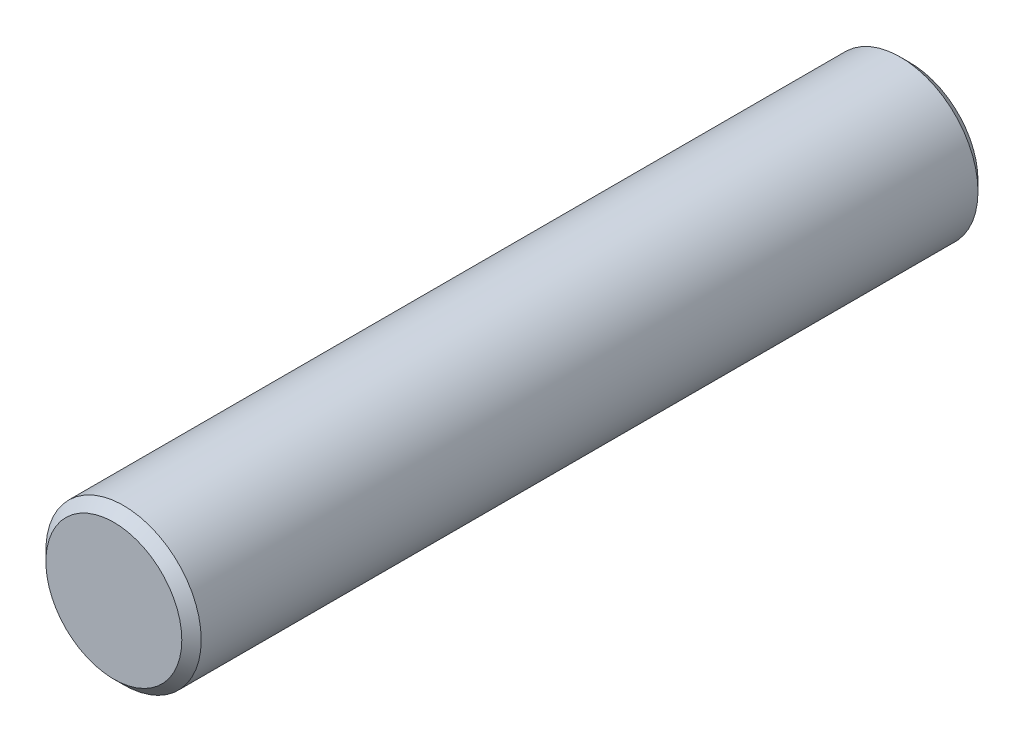
ISO-10303-21;
HEADER;
FILE_DESCRIPTION(('STEP AP214'),'2;1');
FILE_NAME('part.step','',(''),(''),'','','');
FILE_SCHEMA(('AUTOMOTIVE_DESIGN { 1 0 10303 214 1 1 1 1 }'));
ENDSEC;
DATA;
#1=APPLICATION_CONTEXT('core data for automotive mechanical design processes');
#2=APPLICATION_PROTOCOL_DEFINITION('international standard','automotive_design',2000,#1);
#3=PRODUCT_CONTEXT('',#1,'mechanical');
#4=PRODUCT('Part','Part','',(#3));
#5=PRODUCT_RELATED_PRODUCT_CATEGORY('part','',(#4));
#6=PRODUCT_DEFINITION_FORMATION('','',#4);
#7=PRODUCT_DEFINITION_CONTEXT('part definition',#1,'design');
#8=PRODUCT_DEFINITION('design','',#6,#7);
#9=PRODUCT_DEFINITION_SHAPE('','',#8);
#10=(LENGTH_UNIT() NAMED_UNIT(*) SI_UNIT(.MILLI.,.METRE.));
#11=(NAMED_UNIT(*) PLANE_ANGLE_UNIT() SI_UNIT($,.RADIAN.));
#12=(NAMED_UNIT(*) SI_UNIT($,.STERADIAN.) SOLID_ANGLE_UNIT());
#13=UNCERTAINTY_MEASURE_WITH_UNIT(LENGTH_MEASURE(1.E-05),#10,'distance_accuracy_value','');
#14=(GEOMETRIC_REPRESENTATION_CONTEXT(3) GLOBAL_UNCERTAINTY_ASSIGNED_CONTEXT((#13)) GLOBAL_UNIT_ASSIGNED_CONTEXT((#10,
#11,#12)) REPRESENTATION_CONTEXT('',''));
#15=CARTESIAN_POINT('',(0.,0.,0.));
#16=DIRECTION('',(0.,0.,1.));
#17=DIRECTION('',(1.,0.,0.));
#18=AXIS2_PLACEMENT_3D('',#15,#16,#17);
#19=CARTESIAN_POINT('',(0.,0.,41.));
#20=DIRECTION('',(0.,0.,-1.));
#21=DIRECTION('',(-1.,0.,0.));
#22=AXIS2_PLACEMENT_3D('',#19,#20,#21);
#23=CYLINDRICAL_SURFACE('',#22,8.);
#24=CARTESIAN_POINT('',(0.,0.,-40.));
#25=DIRECTION('',(0.,0.,1.));
#26=DIRECTION('',(1.,0.,0.));
#27=AXIS2_PLACEMENT_3D('',#24,#25,#26);
#28=CIRCLE('',#27,8.);
#29=CARTESIAN_POINT('',(8.,0.,-40.));
#30=VERTEX_POINT('',#29);
#31=EDGE_CURVE('E50',#30,#30,#28,.T.);
#32=ORIENTED_EDGE('',*,*,#31,.T.);
#33=EDGE_LOOP('',(#32));
#34=FACE_BOUND('',#33,.T.);
#35=CARTESIAN_POINT('',(0.,0.,40.));
#36=DIRECTION('',(0.,0.,1.));
#37=DIRECTION('',(1.,0.,0.));
#38=AXIS2_PLACEMENT_3D('',#35,#36,#37);
#39=CIRCLE('',#38,8.);
#40=CARTESIAN_POINT('',(8.,0.,40.));
#41=VERTEX_POINT('',#40);
#42=EDGE_CURVE('E55',#41,#41,#39,.F.);
#43=ORIENTED_EDGE('',*,*,#42,.T.);
#44=EDGE_LOOP('',(#43));
#45=FACE_BOUND('',#44,.T.);
#46=ADVANCED_FACE('F37',(#34,#45),#23,.T.);
#47=CARTESIAN_POINT('',(0.,0.,41.));
#48=DIRECTION('',(0.,0.,1.));
#49=DIRECTION('',(1.,0.,0.));
#50=AXIS2_PLACEMENT_3D('',#47,#48,#49);
#51=PLANE('',#50);
#52=CARTESIAN_POINT('',(0.,0.,41.));
#53=DIRECTION('',(0.,0.,1.));
#54=DIRECTION('',(1.,0.,0.));
#55=AXIS2_PLACEMENT_3D('',#52,#53,#54);
#56=CIRCLE('',#55,7.00000000000002);
#57=CARTESIAN_POINT('',(7.00000000000002,0.,41.));
#58=VERTEX_POINT('',#57);
#59=EDGE_CURVE('E10',#58,#58,#56,.T.);
#60=ORIENTED_EDGE('',*,*,#59,.T.);
#61=EDGE_LOOP('',(#60));
#62=FACE_BOUND('',#61,.T.);
#63=ADVANCED_FACE('F72',(#62),#51,.T.);
#64=CARTESIAN_POINT('',(0.,0.,-41.));
#65=DIRECTION('',(0.,0.,1.));
#66=DIRECTION('',(1.,0.,0.));
#67=AXIS2_PLACEMENT_3D('',#64,#65,#66);
#68=PLANE('',#67);
#69=CARTESIAN_POINT('',(0.,0.,-41.));
#70=DIRECTION('',(0.,0.,1.));
#71=DIRECTION('',(1.,0.,0.));
#72=AXIS2_PLACEMENT_3D('',#69,#70,#71);
#73=CIRCLE('',#72,7.);
#74=CARTESIAN_POINT('',(7.,0.,-41.));
#75=VERTEX_POINT('',#74);
#76=EDGE_CURVE('E45',#75,#75,#73,.F.);
#77=ORIENTED_EDGE('',*,*,#76,.T.);
#78=EDGE_LOOP('',(#77));
#79=FACE_BOUND('',#78,.T.);
#80=ADVANCED_FACE('F69',(#79),#68,.F.);
#81=CARTESIAN_POINT('',(0.,0.,-40.));
#82=DIRECTION('',(0.,0.,1.));
#83=DIRECTION('',(1.,0.,0.));
#84=AXIS2_PLACEMENT_3D('',#81,#82,#83);
#85=CONICAL_SURFACE('',#84,8.,0.785398163397455);
#86=ORIENTED_EDGE('',*,*,#76,.F.);
#87=EDGE_LOOP('',(#86));
#88=FACE_BOUND('',#87,.T.);
#89=ORIENTED_EDGE('',*,*,#31,.F.);
#90=EDGE_LOOP('',(#89));
#91=FACE_BOUND('',#90,.T.);
#92=ADVANCED_FACE('F65',(#88,#91),#85,.T.);
#93=CARTESIAN_POINT('',(0.,0.,41.));
#94=DIRECTION('',(0.,0.,-1.));
#95=DIRECTION('',(-1.,0.,0.));
#96=AXIS2_PLACEMENT_3D('',#93,#94,#95);
#97=CONICAL_SURFACE('',#96,7.00000000000002,0.785398163397445);
#98=ORIENTED_EDGE('',*,*,#42,.F.);
#99=EDGE_LOOP('',(#98));
#100=FACE_BOUND('',#99,.T.);
#101=ORIENTED_EDGE('',*,*,#59,.F.);
#102=EDGE_LOOP('',(#101));
#103=FACE_BOUND('',#102,.T.);
#104=ADVANCED_FACE('F39',(#100,#103),#97,.T.);
#105=CLOSED_SHELL('',(#46,#63,#80,#92,#104));
#106=MANIFOLD_SOLID_BREP('B2',#105);
#107=ADVANCED_BREP_SHAPE_REPRESENTATION('',(#18,#106),#14);
#108=SHAPE_DEFINITION_REPRESENTATION(#9,#107);
ENDSEC;
END-ISO-10303-21;
